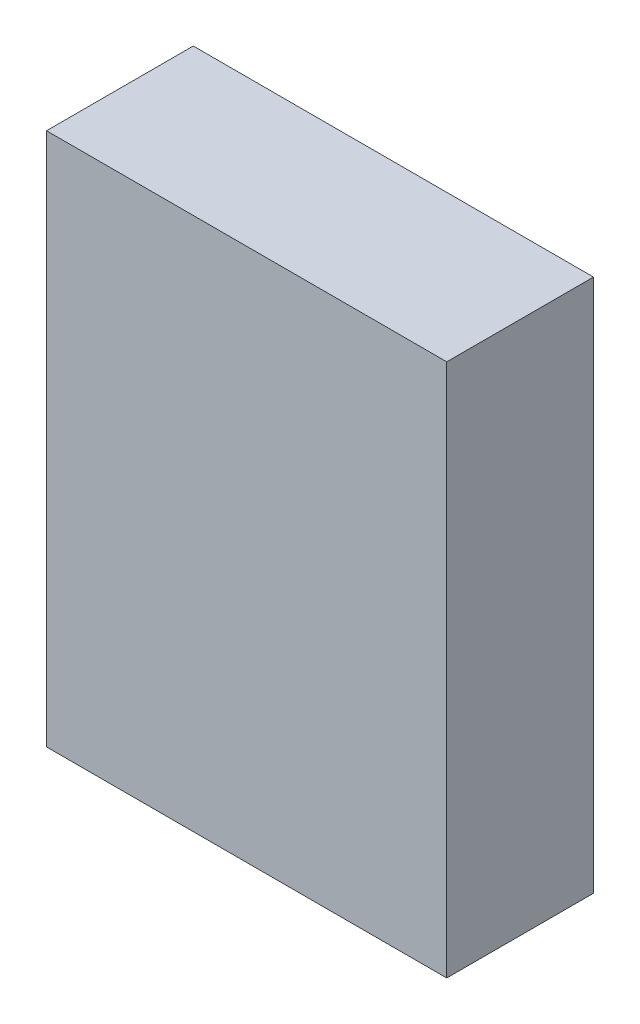
ISO-10303-21;
HEADER;
FILE_DESCRIPTION(('STEP AP214'),'2;1');
FILE_NAME('part.step','',(''),(''),'','','');
FILE_SCHEMA(('AUTOMOTIVE_DESIGN { 1 0 10303 214 1 1 1 1 }'));
ENDSEC;
DATA;
#1=APPLICATION_CONTEXT('core data for automotive mechanical design processes');
#2=APPLICATION_PROTOCOL_DEFINITION('international standard','automotive_design',2000,#1);
#3=PRODUCT_CONTEXT('',#1,'mechanical');
#4=PRODUCT('Part','Part','',(#3));
#5=PRODUCT_RELATED_PRODUCT_CATEGORY('part','',(#4));
#6=PRODUCT_DEFINITION_FORMATION('','',#4);
#7=PRODUCT_DEFINITION_CONTEXT('part definition',#1,'design');
#8=PRODUCT_DEFINITION('design','',#6,#7);
#9=PRODUCT_DEFINITION_SHAPE('','',#8);
#10=(LENGTH_UNIT() NAMED_UNIT(*) SI_UNIT(.MILLI.,.METRE.));
#11=(NAMED_UNIT(*) PLANE_ANGLE_UNIT() SI_UNIT($,.RADIAN.));
#12=(NAMED_UNIT(*) SI_UNIT($,.STERADIAN.) SOLID_ANGLE_UNIT());
#13=UNCERTAINTY_MEASURE_WITH_UNIT(LENGTH_MEASURE(1.E-05),#10,'distance_accuracy_value','');
#14=(GEOMETRIC_REPRESENTATION_CONTEXT(3) GLOBAL_UNCERTAINTY_ASSIGNED_CONTEXT((#13)) GLOBAL_UNIT_ASSIGNED_CONTEXT((#10,
#11,#12)) REPRESENTATION_CONTEXT('',''));
#15=CARTESIAN_POINT('',(0.,0.,0.));
#16=DIRECTION('',(0.,0.,1.));
#17=DIRECTION('',(1.,0.,0.));
#18=AXIS2_PLACEMENT_3D('',#15,#16,#17);
#19=CARTESIAN_POINT('',(1.905,2.54,1.397));
#20=DIRECTION('',(0.,0.,-1.));
#21=DIRECTION('',(-1.,0.,0.));
#22=AXIS2_PLACEMENT_3D('',#19,#20,#21);
#23=PLANE('',#22);
#24=DIRECTION('',(0.,1.,0.));
#25=VECTOR('',#24,1.);
#26=CARTESIAN_POINT('',(-1.905,2.54,1.397));
#27=LINE('',#26,#25);
#28=CARTESIAN_POINT('',(-1.905,2.54,1.397));
#29=VERTEX_POINT('',#28);
#30=CARTESIAN_POINT('',(-1.905,-2.54,1.397));
#31=VERTEX_POINT('',#30);
#32=EDGE_CURVE('E55',#29,#31,#27,.F.);
#33=ORIENTED_EDGE('',*,*,#32,.T.);
#34=DIRECTION('',(1.,0.,0.));
#35=VECTOR('',#34,1.);
#36=CARTESIAN_POINT('',(-1.905,-2.54,1.397));
#37=LINE('',#36,#35);
#38=CARTESIAN_POINT('',(1.905,-2.54,1.397));
#39=VERTEX_POINT('',#38);
#40=EDGE_CURVE('E57',#31,#39,#37,.T.);
#41=ORIENTED_EDGE('',*,*,#40,.T.);
#42=DIRECTION('',(0.,1.,0.));
#43=VECTOR('',#42,1.);
#44=CARTESIAN_POINT('',(1.905,-2.54,1.397));
#45=LINE('',#44,#43);
#46=CARTESIAN_POINT('',(1.905,2.54,1.397));
#47=VERTEX_POINT('',#46);
#48=EDGE_CURVE('E20',#39,#47,#45,.T.);
#49=ORIENTED_EDGE('',*,*,#48,.T.);
#50=DIRECTION('',(1.,0.,0.));
#51=VECTOR('',#50,1.);
#52=CARTESIAN_POINT('',(1.905,2.54,1.397));
#53=LINE('',#52,#51);
#54=EDGE_CURVE('E80',#47,#29,#53,.F.);
#55=ORIENTED_EDGE('',*,*,#54,.T.);
#56=EDGE_LOOP('',(#33,#41,#49,#55));
#57=FACE_BOUND('',#56,.T.);
#58=ADVANCED_FACE('F17',(#57),#23,.F.);
#59=CARTESIAN_POINT('',(1.905,-2.54,0.));
#60=DIRECTION('',(-1.,0.,0.));
#61=DIRECTION('',(0.,0.,1.));
#62=AXIS2_PLACEMENT_3D('',#59,#60,#61);
#63=PLANE('',#62);
#64=DIRECTION('',(0.,0.,1.));
#65=VECTOR('',#64,1.);
#66=CARTESIAN_POINT('',(1.905,-2.54,0.));
#67=LINE('',#66,#65);
#68=CARTESIAN_POINT('',(1.905,-2.54,0.));
#69=VERTEX_POINT('',#68);
#70=EDGE_CURVE('E63',#39,#69,#67,.F.);
#71=ORIENTED_EDGE('',*,*,#70,.T.);
#72=DIRECTION('',(0.,1.,0.));
#73=VECTOR('',#72,1.);
#74=CARTESIAN_POINT('',(1.905,2.54,0.));
#75=LINE('',#74,#73);
#76=CARTESIAN_POINT('',(1.905,2.54,0.));
#77=VERTEX_POINT('',#76);
#78=EDGE_CURVE('E83',#77,#69,#75,.F.);
#79=ORIENTED_EDGE('',*,*,#78,.F.);
#80=DIRECTION('',(0.,0.,-1.));
#81=VECTOR('',#80,1.);
#82=CARTESIAN_POINT('',(1.905,2.54,0.));
#83=LINE('',#82,#81);
#84=EDGE_CURVE('E69',#77,#47,#83,.F.);
#85=ORIENTED_EDGE('',*,*,#84,.T.);
#86=ORIENTED_EDGE('',*,*,#48,.F.);
#87=EDGE_LOOP('',(#71,#79,#85,#86));
#88=FACE_BOUND('',#87,.T.);
#89=ADVANCED_FACE('F66',(#88),#63,.F.);
#90=CARTESIAN_POINT('',(-1.905,-2.54,0.));
#91=DIRECTION('',(0.,1.,0.));
#92=DIRECTION('',(0.,0.,1.));
#93=AXIS2_PLACEMENT_3D('',#90,#91,#92);
#94=PLANE('',#93);
#95=ORIENTED_EDGE('',*,*,#70,.F.);
#96=ORIENTED_EDGE('',*,*,#40,.F.);
#97=DIRECTION('',(0.,0.,-1.));
#98=VECTOR('',#97,1.);
#99=CARTESIAN_POINT('',(-1.905,-2.54,0.));
#100=LINE('',#99,#98);
#101=CARTESIAN_POINT('',(-1.905,-2.54,0.));
#102=VERTEX_POINT('',#101);
#103=EDGE_CURVE('E75',#31,#102,#100,.T.);
#104=ORIENTED_EDGE('',*,*,#103,.T.);
#105=DIRECTION('',(-1.,0.,0.));
#106=VECTOR('',#105,1.);
#107=CARTESIAN_POINT('',(1.905,-2.54,0.));
#108=LINE('',#107,#106);
#109=EDGE_CURVE('E73',#69,#102,#108,.T.);
#110=ORIENTED_EDGE('',*,*,#109,.F.);
#111=EDGE_LOOP('',(#95,#96,#104,#110));
#112=FACE_BOUND('',#111,.T.);
#113=ADVANCED_FACE('F71',(#112),#94,.F.);
#114=CARTESIAN_POINT('',(-1.905,2.54,0.));
#115=DIRECTION('',(1.,0.,0.));
#116=DIRECTION('',(0.,0.,-1.));
#117=AXIS2_PLACEMENT_3D('',#114,#115,#116);
#118=PLANE('',#117);
#119=ORIENTED_EDGE('',*,*,#103,.F.);
#120=ORIENTED_EDGE('',*,*,#32,.F.);
#121=DIRECTION('',(0.,0.,-1.));
#122=VECTOR('',#121,1.);
#123=CARTESIAN_POINT('',(-1.905,2.54,0.));
#124=LINE('',#123,#122);
#125=CARTESIAN_POINT('',(-1.905,2.54,0.));
#126=VERTEX_POINT('',#125);
#127=EDGE_CURVE('E35',#29,#126,#124,.T.);
#128=ORIENTED_EDGE('',*,*,#127,.T.);
#129=DIRECTION('',(0.,1.,0.));
#130=VECTOR('',#129,1.);
#131=CARTESIAN_POINT('',(-1.905,2.54,0.));
#132=LINE('',#131,#130);
#133=EDGE_CURVE('E26',#102,#126,#132,.T.);
#134=ORIENTED_EDGE('',*,*,#133,.F.);
#135=EDGE_LOOP('',(#119,#120,#128,#134));
#136=FACE_BOUND('',#135,.T.);
#137=ADVANCED_FACE('F89',(#136),#118,.F.);
#138=CARTESIAN_POINT('',(1.905,2.54,0.));
#139=DIRECTION('',(0.,-1.,0.));
#140=DIRECTION('',(0.,0.,-1.));
#141=AXIS2_PLACEMENT_3D('',#138,#139,#140);
#142=PLANE('',#141);
#143=ORIENTED_EDGE('',*,*,#127,.F.);
#144=ORIENTED_EDGE('',*,*,#54,.F.);
#145=ORIENTED_EDGE('',*,*,#84,.F.);
#146=DIRECTION('',(-1.,0.,0.));
#147=VECTOR('',#146,1.);
#148=CARTESIAN_POINT('',(1.905,2.54,0.));
#149=LINE('',#148,#147);
#150=EDGE_CURVE('E11',#126,#77,#149,.F.);
#151=ORIENTED_EDGE('',*,*,#150,.F.);
#152=EDGE_LOOP('',(#143,#144,#145,#151));
#153=FACE_BOUND('',#152,.T.);
#154=ADVANCED_FACE('F91',(#153),#142,.F.);
#155=CARTESIAN_POINT('',(1.905,2.54,0.));
#156=DIRECTION('',(0.,0.,-1.));
#157=DIRECTION('',(-1.,0.,0.));
#158=AXIS2_PLACEMENT_3D('',#155,#156,#157);
#159=PLANE('',#158);
#160=ORIENTED_EDGE('',*,*,#133,.T.);
#161=ORIENTED_EDGE('',*,*,#150,.T.);
#162=ORIENTED_EDGE('',*,*,#78,.T.);
#163=ORIENTED_EDGE('',*,*,#109,.T.);
#164=EDGE_LOOP('',(#160,#161,#162,#163));
#165=FACE_BOUND('',#164,.T.);
#166=ADVANCED_FACE('F88',(#165),#159,.T.);
#167=CLOSED_SHELL('',(#58,#89,#113,#137,#154,#166));
#168=MANIFOLD_SOLID_BREP('B1',#167);
#169=ADVANCED_BREP_SHAPE_REPRESENTATION('',(#18,#168),#14);
#170=SHAPE_DEFINITION_REPRESENTATION(#9,#169);
ENDSEC;
END-ISO-10303-21;
